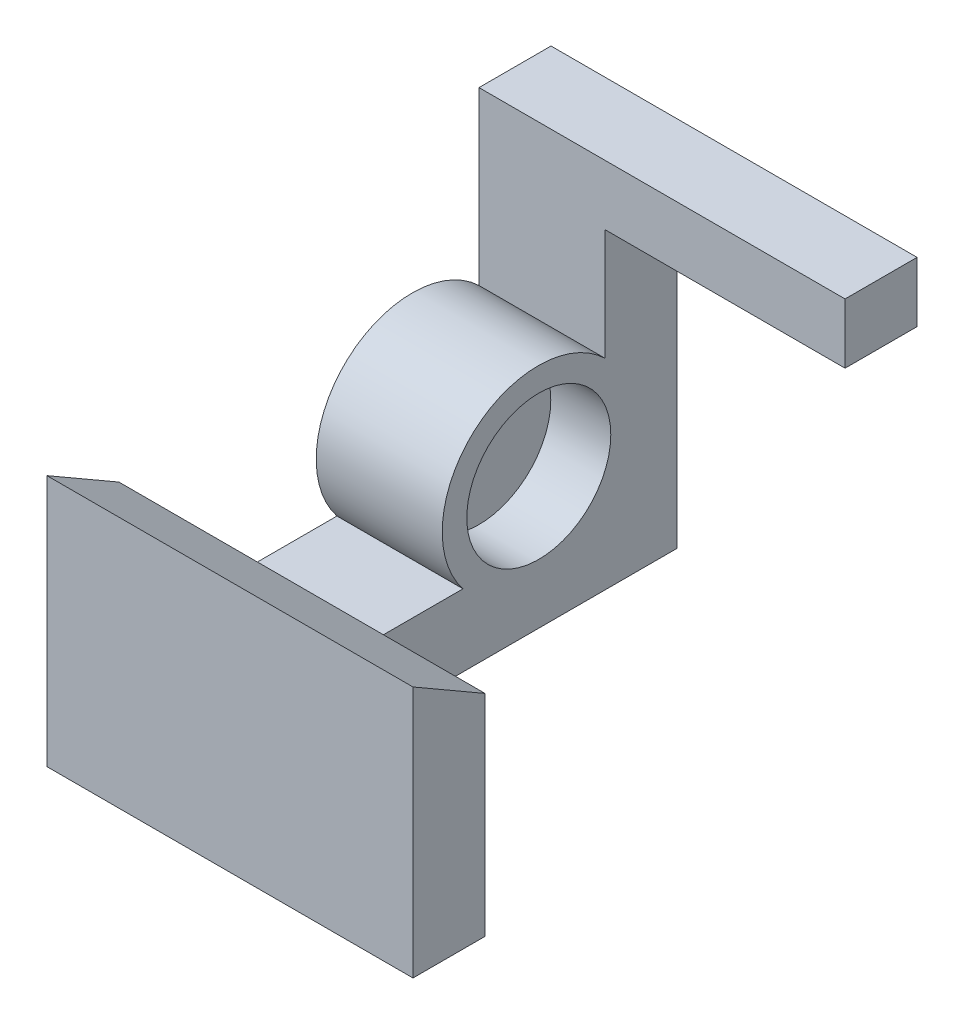
ISO-10303-21;
HEADER;
FILE_DESCRIPTION(('STEP AP214'),'2;1');
FILE_NAME('part.step','',(''),(''),'','','');
FILE_SCHEMA(('AUTOMOTIVE_DESIGN { 1 0 10303 214 1 1 1 1 }'));
ENDSEC;
DATA;
#1=APPLICATION_CONTEXT('core data for automotive mechanical design processes');
#2=APPLICATION_PROTOCOL_DEFINITION('international standard','automotive_design',2000,#1);
#3=PRODUCT_CONTEXT('',#1,'mechanical');
#4=PRODUCT('Part','Part','',(#3));
#5=PRODUCT_RELATED_PRODUCT_CATEGORY('part','',(#4));
#6=PRODUCT_DEFINITION_FORMATION('','',#4);
#7=PRODUCT_DEFINITION_CONTEXT('part definition',#1,'design');
#8=PRODUCT_DEFINITION('design','',#6,#7);
#9=PRODUCT_DEFINITION_SHAPE('','',#8);
#10=(LENGTH_UNIT() NAMED_UNIT(*) SI_UNIT(.MILLI.,.METRE.));
#11=(NAMED_UNIT(*) PLANE_ANGLE_UNIT() SI_UNIT($,.RADIAN.));
#12=(NAMED_UNIT(*) SI_UNIT($,.STERADIAN.) SOLID_ANGLE_UNIT());
#13=UNCERTAINTY_MEASURE_WITH_UNIT(LENGTH_MEASURE(1.E-05),#10,'distance_accuracy_value','');
#14=(GEOMETRIC_REPRESENTATION_CONTEXT(3) GLOBAL_UNCERTAINTY_ASSIGNED_CONTEXT((#13)) GLOBAL_UNIT_ASSIGNED_CONTEXT((#10,
#11,#12)) REPRESENTATION_CONTEXT('',''));
#15=CARTESIAN_POINT('',(0.,0.,0.));
#16=DIRECTION('',(0.,0.,1.));
#17=DIRECTION('',(1.,0.,0.));
#18=AXIS2_PLACEMENT_3D('',#15,#16,#17);
#19=CARTESIAN_POINT('',(-10.5,5.92715231788079,8.85107205144952));
#20=DIRECTION('',(1.,0.,0.));
#21=DIRECTION('',(0.,0.,-1.));
#22=AXIS2_PLACEMENT_3D('',#19,#20,#21);
#23=PLANE('',#22);
#24=DIRECTION('',(0.,-0.500000000000004,-0.866025403784436));
#25=VECTOR('',#24,1.);
#26=CARTESIAN_POINT('',(-10.5,15.9602649006623,39.2881581441647));
#27=LINE('',#26,#25);
#28=CARTESIAN_POINT('',(-10.5,15.9602649006623,39.2881581441647));
#29=VERTEX_POINT('',#28);
#30=CARTESIAN_POINT('',(-10.5,12.4961632855245,33.2881581441647));
#31=VERTEX_POINT('',#30);
#32=EDGE_CURVE('E132',#29,#31,#27,.T.);
#33=ORIENTED_EDGE('',*,*,#32,.T.);
#34=DIRECTION('',(0.,-1.,0.));
#35=VECTOR('',#34,1.);
#36=CARTESIAN_POINT('',(-10.5,15.9602649006623,33.2881581441647));
#37=LINE('',#36,#35);
#38=CARTESIAN_POINT('',(-10.5,0.960264900662255,33.2881581441647));
#39=VERTEX_POINT('',#38);
#40=EDGE_CURVE('E141',#31,#39,#37,.T.);
#41=ORIENTED_EDGE('',*,*,#40,.T.);
#42=DIRECTION('',(0.,0.,1.));
#43=VECTOR('',#42,1.);
#44=CARTESIAN_POINT('',(-10.5,0.960264900662257,15.1224378823253));
#45=LINE('',#44,#43);
#46=CARTESIAN_POINT('',(-10.5,0.960264900662259,15.1224378823253));
#47=VERTEX_POINT('',#46);
#48=EDGE_CURVE('E205',#47,#39,#45,.T.);
#49=ORIENTED_EDGE('',*,*,#48,.F.);
#50=CARTESIAN_POINT('',(-10.5,5.92715231788079,8.85107205144952));
#51=DIRECTION('',(1.,0.,0.));
#52=DIRECTION('',(0.,0.,-1.));
#53=AXIS2_PLACEMENT_3D('',#50,#51,#52);
#54=CIRCLE('',#53,8.);
#55=CARTESIAN_POINT('',(-10.5,11.676412171126,3.28815814416473));
#56=VERTEX_POINT('',#55);
#57=EDGE_CURVE('E203',#56,#47,#54,.T.);
#58=ORIENTED_EDGE('',*,*,#57,.F.);
#59=DIRECTION('',(0.,-1.,0.));
#60=VECTOR('',#59,1.);
#61=CARTESIAN_POINT('',(-10.5,20.9602649006623,3.28815814416473));
#62=LINE('',#61,#60);
#63=CARTESIAN_POINT('',(-10.5,25.9602649006623,3.28815814416473));
#64=VERTEX_POINT('',#63);
#65=EDGE_CURVE('E199',#64,#56,#62,.T.);
#66=ORIENTED_EDGE('',*,*,#65,.F.);
#67=DIRECTION('',(0.,0.,1.));
#68=VECTOR('',#67,1.);
#69=CARTESIAN_POINT('',(-10.5,25.9602649006623,-2.71184185583527));
#70=LINE('',#69,#68);
#71=CARTESIAN_POINT('',(-10.5,25.9602649006623,-2.71184185583527));
#72=VERTEX_POINT('',#71);
#73=EDGE_CURVE('E176',#72,#64,#70,.T.);
#74=ORIENTED_EDGE('',*,*,#73,.F.);
#75=DIRECTION('',(0.,1.,0.));
#76=VECTOR('',#75,1.);
#77=CARTESIAN_POINT('',(-10.5,20.9602649006623,-2.71184185583527));
#78=LINE('',#77,#76);
#79=CARTESIAN_POINT('',(-10.5,-5.03973509933774,-2.71184185583527));
#80=VERTEX_POINT('',#79);
#81=EDGE_CURVE('E197',#80,#72,#78,.T.);
#82=ORIENTED_EDGE('',*,*,#81,.F.);
#83=DIRECTION('',(0.,0.,-1.));
#84=VECTOR('',#83,1.);
#85=CARTESIAN_POINT('',(-10.5,-5.03973509933774,-2.71184185583527));
#86=LINE('',#85,#84);
#87=CARTESIAN_POINT('',(-10.5,-5.03973509933774,39.2881581441647));
#88=VERTEX_POINT('',#87);
#89=EDGE_CURVE('E207',#88,#80,#86,.T.);
#90=ORIENTED_EDGE('',*,*,#89,.F.);
#91=DIRECTION('',(0.,-1.,0.));
#92=VECTOR('',#91,1.);
#93=CARTESIAN_POINT('',(-10.5,-5.03973509933774,39.2881581441647));
#94=LINE('',#93,#92);
#95=EDGE_CURVE('E144',#29,#88,#94,.T.);
#96=ORIENTED_EDGE('',*,*,#95,.F.);
#97=EDGE_LOOP('',(#33,#41,#49,#58,#66,#74,#82,#90,#96));
#98=FACE_BOUND('',#97,.T.);
#99=ADVANCED_FACE('F32',(#98),#23,.F.);
#100=CARTESIAN_POINT('',(0.,0.,33.2881581441647));
#101=DIRECTION('',(0.,0.,-1.));
#102=DIRECTION('',(-1.,0.,0.));
#103=AXIS2_PLACEMENT_3D('',#100,#101,#102);
#104=PLANE('',#103);
#105=ORIENTED_EDGE('',*,*,#40,.F.);
#106=DIRECTION('',(-1.,0.,0.));
#107=VECTOR('',#106,1.);
#108=CARTESIAN_POINT('',(20.000025,12.4961632855245,33.2881581441647));
#109=LINE('',#108,#107);
#110=CARTESIAN_POINT('',(20.,12.4961632855245,33.2881581441647));
#111=VERTEX_POINT('',#110);
#112=EDGE_CURVE('E129',#111,#31,#109,.T.);
#113=ORIENTED_EDGE('',*,*,#112,.F.);
#114=DIRECTION('',(0.,1.,0.));
#115=VECTOR('',#114,1.);
#116=CARTESIAN_POINT('',(20.,-5.03973509933774,33.2881581441647));
#117=LINE('',#116,#115);
#118=CARTESIAN_POINT('',(20.,-5.03973509933774,33.2881581441647));
#119=VERTEX_POINT('',#118);
#120=EDGE_CURVE('E165',#119,#111,#117,.T.);
#121=ORIENTED_EDGE('',*,*,#120,.F.);
#122=DIRECTION('',(1.,0.,0.));
#123=VECTOR('',#122,1.);
#124=CARTESIAN_POINT('',(-10.5,-5.03973509933774,33.2881581441647));
#125=LINE('',#124,#123);
#126=CARTESIAN_POINT('',(0.,-5.03973509933774,33.2881581441647));
#127=VERTEX_POINT('',#126);
#128=EDGE_CURVE('E71',#127,#119,#125,.T.);
#129=ORIENTED_EDGE('',*,*,#128,.F.);
#130=DIRECTION('',(0.,-1.,0.));
#131=VECTOR('',#130,1.);
#132=CARTESIAN_POINT('',(0.,0.960264900662255,33.2881581441647));
#133=LINE('',#132,#131);
#134=CARTESIAN_POINT('',(0.,0.960264900662255,33.2881581441647));
#135=VERTEX_POINT('',#134);
#136=EDGE_CURVE('E227',#135,#127,#133,.T.);
#137=ORIENTED_EDGE('',*,*,#136,.F.);
#138=DIRECTION('',(-1.,0.,0.));
#139=VECTOR('',#138,1.);
#140=CARTESIAN_POINT('',(20.,0.960264900662255,33.2881581441647));
#141=LINE('',#140,#139);
#142=EDGE_CURVE('E148',#135,#39,#141,.T.);
#143=ORIENTED_EDGE('',*,*,#142,.T.);
#144=EDGE_LOOP('',(#105,#113,#121,#129,#137,#143));
#145=FACE_BOUND('',#144,.T.);
#146=ADVANCED_FACE('F147',(#145),#104,.T.);
#147=CARTESIAN_POINT('',(20.,-5.03973509933774,39.2881581441647));
#148=DIRECTION('',(-1.,0.,0.));
#149=DIRECTION('',(0.,-1.,0.));
#150=AXIS2_PLACEMENT_3D('',#147,#148,#149);
#151=PLANE('',#150);
#152=DIRECTION('',(0.,-0.500000000000005,-0.866025403784436));
#153=VECTOR('',#152,1.);
#154=CARTESIAN_POINT('',(20.,10.7102649006622,30.1948914044281));
#155=LINE('',#154,#153);
#156=CARTESIAN_POINT('',(20.,15.9602649006623,39.2881581441647));
#157=VERTEX_POINT('',#156);
#158=EDGE_CURVE('E135',#157,#111,#155,.T.);
#159=ORIENTED_EDGE('',*,*,#158,.F.);
#160=DIRECTION('',(0.,1.,0.));
#161=VECTOR('',#160,1.);
#162=CARTESIAN_POINT('',(20.,-5.03973509933774,39.2881581441647));
#163=LINE('',#162,#161);
#164=CARTESIAN_POINT('',(20.,-5.03973509933774,39.2881581441647));
#165=VERTEX_POINT('',#164);
#166=EDGE_CURVE('E167',#165,#157,#163,.T.);
#167=ORIENTED_EDGE('',*,*,#166,.F.);
#168=DIRECTION('',(0.,0.,-1.));
#169=VECTOR('',#168,1.);
#170=CARTESIAN_POINT('',(20.,-5.03973509933774,39.2881581441647));
#171=LINE('',#170,#169);
#172=EDGE_CURVE('E170',#165,#119,#171,.T.);
#173=ORIENTED_EDGE('',*,*,#172,.T.);
#174=ORIENTED_EDGE('',*,*,#120,.T.);
#175=EDGE_LOOP('',(#159,#167,#173,#174));
#176=FACE_BOUND('',#175,.T.);
#177=ADVANCED_FACE('F262',(#176),#151,.F.);
#178=CARTESIAN_POINT('',(-10.5,0.960264900662257,15.1224378823253));
#179=DIRECTION('',(0.,1.,0.));
#180=DIRECTION('',(0.,0.,1.));
#181=AXIS2_PLACEMENT_3D('',#178,#179,#180);
#182=PLANE('',#181);
#183=ORIENTED_EDGE('',*,*,#48,.T.);
#184=ORIENTED_EDGE('',*,*,#142,.F.);
#185=DIRECTION('',(0.,0.,1.));
#186=VECTOR('',#185,1.);
#187=CARTESIAN_POINT('',(0.,0.960264900662257,15.1224378823253));
#188=LINE('',#187,#186);
#189=CARTESIAN_POINT('',(0.,0.960264900662259,15.1224378823253));
#190=VERTEX_POINT('',#189);
#191=EDGE_CURVE('E229',#190,#135,#188,.T.);
#192=ORIENTED_EDGE('',*,*,#191,.F.);
#193=DIRECTION('',(1.,0.,0.));
#194=VECTOR('',#193,1.);
#195=CARTESIAN_POINT('',(-10.5,0.960264900662259,15.1224378823253));
#196=LINE('',#195,#194);
#197=EDGE_CURVE('E42',#47,#190,#196,.T.);
#198=ORIENTED_EDGE('',*,*,#197,.F.);
#199=EDGE_LOOP('',(#183,#184,#192,#198));
#200=FACE_BOUND('',#199,.T.);
#201=ADVANCED_FACE('F244',(#200),#182,.T.);
#202=CARTESIAN_POINT('',(-10.5,20.9602649006623,-2.71184185583527));
#203=DIRECTION('',(0.,0.,-1.));
#204=DIRECTION('',(0.,1.,0.));
#205=AXIS2_PLACEMENT_3D('',#202,#203,#204);
#206=PLANE('',#205);
#207=DIRECTION('',(0.,1.,0.));
#208=VECTOR('',#207,1.);
#209=CARTESIAN_POINT('',(0.,20.9602649006623,-2.71184185583527));
#210=LINE('',#209,#208);
#211=CARTESIAN_POINT('',(0.,-5.03973509933774,-2.71184185583527));
#212=VERTEX_POINT('',#211);
#213=CARTESIAN_POINT('',(0.,20.9602649006623,-2.71184185583527));
#214=VERTEX_POINT('',#213);
#215=EDGE_CURVE('E219',#212,#214,#210,.T.);
#216=ORIENTED_EDGE('',*,*,#215,.F.);
#217=DIRECTION('',(1.,0.,0.));
#218=VECTOR('',#217,1.);
#219=CARTESIAN_POINT('',(-10.5,-5.03973509933774,-2.71184185583527));
#220=LINE('',#219,#218);
#221=EDGE_CURVE('E11',#80,#212,#220,.T.);
#222=ORIENTED_EDGE('',*,*,#221,.F.);
#223=ORIENTED_EDGE('',*,*,#81,.T.);
#224=DIRECTION('',(-1.,0.,0.));
#225=VECTOR('',#224,1.);
#226=CARTESIAN_POINT('',(-10.5,25.9602649006623,-2.71184185583527));
#227=LINE('',#226,#225);
#228=CARTESIAN_POINT('',(20.,25.9602649006623,-2.71184185583527));
#229=VERTEX_POINT('',#228);
#230=EDGE_CURVE('E184',#229,#72,#227,.T.);
#231=ORIENTED_EDGE('',*,*,#230,.F.);
#232=DIRECTION('',(0.,-1.,0.));
#233=VECTOR('',#232,1.);
#234=CARTESIAN_POINT('',(20.,25.9602649006623,-2.71184185583527));
#235=LINE('',#234,#233);
#236=CARTESIAN_POINT('',(20.,20.9602649006623,-2.71184185583527));
#237=VERTEX_POINT('',#236);
#238=EDGE_CURVE('E187',#229,#237,#235,.T.);
#239=ORIENTED_EDGE('',*,*,#238,.T.);
#240=DIRECTION('',(-1.,0.,0.));
#241=VECTOR('',#240,1.);
#242=CARTESIAN_POINT('',(-10.5,20.9602649006623,-2.71184185583527));
#243=LINE('',#242,#241);
#244=EDGE_CURVE('E180',#237,#214,#243,.T.);
#245=ORIENTED_EDGE('',*,*,#244,.T.);
#246=EDGE_LOOP('',(#216,#222,#223,#231,#239,#245));
#247=FACE_BOUND('',#246,.T.);
#248=ADVANCED_FACE('F34',(#247),#206,.T.);
#249=CARTESIAN_POINT('',(-10.5,-5.03973509933774,-2.71184185583527));
#250=DIRECTION('',(0.,-1.,0.));
#251=DIRECTION('',(0.,0.,-1.));
#252=AXIS2_PLACEMENT_3D('',#249,#250,#251);
#253=PLANE('',#252);
#254=DIRECTION('',(0.,0.,-1.));
#255=VECTOR('',#254,1.);
#256=CARTESIAN_POINT('',(0.,-5.03973509933774,-2.71184185583527));
#257=LINE('',#256,#255);
#258=EDGE_CURVE('E200',#127,#212,#257,.T.);
#259=ORIENTED_EDGE('',*,*,#258,.F.);
#260=ORIENTED_EDGE('',*,*,#128,.T.);
#261=ORIENTED_EDGE('',*,*,#172,.F.);
#262=DIRECTION('',(1.,0.,0.));
#263=VECTOR('',#262,1.);
#264=CARTESIAN_POINT('',(-10.5,-5.03973509933774,39.2881581441647));
#265=LINE('',#264,#263);
#266=EDGE_CURVE('E164',#88,#165,#265,.T.);
#267=ORIENTED_EDGE('',*,*,#266,.F.);
#268=ORIENTED_EDGE('',*,*,#89,.T.);
#269=ORIENTED_EDGE('',*,*,#221,.T.);
#270=EDGE_LOOP('',(#259,#260,#261,#267,#268,#269));
#271=FACE_BOUND('',#270,.T.);
#272=ADVANCED_FACE('F248',(#271),#253,.T.);
#273=CARTESIAN_POINT('',(-10.5,5.92715231788079,8.85107205144952));
#274=DIRECTION('',(1.,0.,0.));
#275=DIRECTION('',(0.,0.,-1.));
#276=AXIS2_PLACEMENT_3D('',#273,#274,#275);
#277=CYLINDRICAL_SURFACE('',#276,8.);
#278=CARTESIAN_POINT('',(0.,5.92715231788079,8.85107205144952));
#279=DIRECTION('',(1.,0.,0.));
#280=DIRECTION('',(0.,0.,-1.));
#281=AXIS2_PLACEMENT_3D('',#278,#279,#280);
#282=CIRCLE('',#281,8.);
#283=CARTESIAN_POINT('',(0.,11.676412171126,3.28815814416473));
#284=VERTEX_POINT('',#283);
#285=EDGE_CURVE('E211',#284,#190,#282,.T.);
#286=ORIENTED_EDGE('',*,*,#285,.F.);
#287=DIRECTION('',(1.,0.,0.));
#288=VECTOR('',#287,1.);
#289=CARTESIAN_POINT('',(-10.5,11.676412171126,3.28815814416473));
#290=LINE('',#289,#288);
#291=EDGE_CURVE('E80',#56,#284,#290,.T.);
#292=ORIENTED_EDGE('',*,*,#291,.F.);
#293=ORIENTED_EDGE('',*,*,#57,.T.);
#294=ORIENTED_EDGE('',*,*,#197,.T.);
#295=EDGE_LOOP('',(#286,#292,#293,#294));
#296=FACE_BOUND('',#295,.T.);
#297=ADVANCED_FACE('F245',(#296),#277,.T.);
#298=CARTESIAN_POINT('',(-10.5,20.9602649006623,3.28815814416473));
#299=DIRECTION('',(0.,0.,1.));
#300=DIRECTION('',(1.,0.,0.));
#301=AXIS2_PLACEMENT_3D('',#298,#299,#300);
#302=PLANE('',#301);
#303=DIRECTION('',(0.,-1.,0.));
#304=VECTOR('',#303,1.);
#305=CARTESIAN_POINT('',(0.,20.9602649006623,3.28815814416473));
#306=LINE('',#305,#304);
#307=CARTESIAN_POINT('',(0.,20.9602649006623,3.28815814416473));
#308=VERTEX_POINT('',#307);
#309=EDGE_CURVE('E218',#308,#284,#306,.T.);
#310=ORIENTED_EDGE('',*,*,#309,.F.);
#311=DIRECTION('',(1.,0.,0.));
#312=VECTOR('',#311,1.);
#313=CARTESIAN_POINT('',(-10.5,20.9602649006623,3.28815814416473));
#314=LINE('',#313,#312);
#315=CARTESIAN_POINT('',(20.,20.9602649006623,3.28815814416473));
#316=VERTEX_POINT('',#315);
#317=EDGE_CURVE('E193',#308,#316,#314,.T.);
#318=ORIENTED_EDGE('',*,*,#317,.T.);
#319=DIRECTION('',(0.,-1.,0.));
#320=VECTOR('',#319,1.);
#321=CARTESIAN_POINT('',(20.,25.9602649006623,3.28815814416473));
#322=LINE('',#321,#320);
#323=CARTESIAN_POINT('',(20.,25.9602649006623,3.28815814416473));
#324=VERTEX_POINT('',#323);
#325=EDGE_CURVE('E224',#324,#316,#322,.T.);
#326=ORIENTED_EDGE('',*,*,#325,.F.);
#327=DIRECTION('',(1.,0.,0.));
#328=VECTOR('',#327,1.);
#329=CARTESIAN_POINT('',(-10.5,25.9602649006623,3.28815814416473));
#330=LINE('',#329,#328);
#331=EDGE_CURVE('E179',#64,#324,#330,.T.);
#332=ORIENTED_EDGE('',*,*,#331,.F.);
#333=ORIENTED_EDGE('',*,*,#65,.T.);
#334=ORIENTED_EDGE('',*,*,#291,.T.);
#335=EDGE_LOOP('',(#310,#318,#326,#332,#333,#334));
#336=FACE_BOUND('',#335,.T.);
#337=ADVANCED_FACE('F247',(#336),#302,.T.);
#338=CARTESIAN_POINT('',(0.,5.92715231788079,8.85107205144952));
#339=DIRECTION('',(1.,0.,0.));
#340=DIRECTION('',(0.,0.,-1.));
#341=AXIS2_PLACEMENT_3D('',#338,#339,#340);
#342=PLANE('',#341);
#343=CARTESIAN_POINT('',(0.,5.92386765901937,8.80693946290523));
#344=DIRECTION('',(1.,0.,0.));
#345=DIRECTION('',(0.,0.,-1.));
#346=AXIS2_PLACEMENT_3D('',#343,#344,#345);
#347=CIRCLE('',#346,6.);
#348=CARTESIAN_POINT('',(0.,5.92386765901937,2.80693946290523));
#349=VERTEX_POINT('',#348);
#350=EDGE_CURVE('E150',#349,#349,#347,.T.);
#351=ORIENTED_EDGE('',*,*,#350,.F.);
#352=EDGE_LOOP('',(#351));
#353=FACE_BOUND('',#352,.T.);
#354=ORIENTED_EDGE('',*,*,#215,.T.);
#355=DIRECTION('',(0.,0.,1.));
#356=VECTOR('',#355,1.);
#357=CARTESIAN_POINT('',(0.,20.9602649006623,-2.71184185583527));
#358=LINE('',#357,#356);
#359=EDGE_CURVE('E214',#214,#308,#358,.T.);
#360=ORIENTED_EDGE('',*,*,#359,.T.);
#361=ORIENTED_EDGE('',*,*,#309,.T.);
#362=ORIENTED_EDGE('',*,*,#285,.T.);
#363=ORIENTED_EDGE('',*,*,#191,.T.);
#364=ORIENTED_EDGE('',*,*,#136,.T.);
#365=ORIENTED_EDGE('',*,*,#258,.T.);
#366=EDGE_LOOP('',(#354,#360,#361,#362,#363,#364,#365));
#367=FACE_BOUND('',#366,.T.);
#368=ADVANCED_FACE('F241',(#353,#367),#342,.T.);
#369=CARTESIAN_POINT('',(20.,25.9602649006623,-2.71184185583527));
#370=DIRECTION('',(-1.,0.,0.));
#371=DIRECTION('',(0.,0.,1.));
#372=AXIS2_PLACEMENT_3D('',#369,#370,#371);
#373=PLANE('',#372);
#374=DIRECTION('',(0.,0.,-1.));
#375=VECTOR('',#374,1.);
#376=CARTESIAN_POINT('',(20.,20.9602649006623,-2.71184185583527));
#377=LINE('',#376,#375);
#378=EDGE_CURVE('E190',#316,#237,#377,.T.);
#379=ORIENTED_EDGE('',*,*,#378,.T.);
#380=ORIENTED_EDGE('',*,*,#238,.F.);
#381=DIRECTION('',(0.,0.,-1.));
#382=VECTOR('',#381,1.);
#383=CARTESIAN_POINT('',(20.,25.9602649006623,-2.71184185583527));
#384=LINE('',#383,#382);
#385=EDGE_CURVE('E182',#324,#229,#384,.T.);
#386=ORIENTED_EDGE('',*,*,#385,.F.);
#387=ORIENTED_EDGE('',*,*,#325,.T.);
#388=EDGE_LOOP('',(#379,#380,#386,#387));
#389=FACE_BOUND('',#388,.T.);
#390=ADVANCED_FACE('F266',(#389),#373,.F.);
#391=CARTESIAN_POINT('',(0.,25.9602649006623,0.));
#392=DIRECTION('',(0.,1.,0.));
#393=DIRECTION('',(0.,0.,1.));
#394=AXIS2_PLACEMENT_3D('',#391,#392,#393);
#395=PLANE('',#394);
#396=ORIENTED_EDGE('',*,*,#73,.T.);
#397=ORIENTED_EDGE('',*,*,#331,.T.);
#398=ORIENTED_EDGE('',*,*,#385,.T.);
#399=ORIENTED_EDGE('',*,*,#230,.T.);
#400=EDGE_LOOP('',(#396,#397,#398,#399));
#401=FACE_BOUND('',#400,.T.);
#402=ADVANCED_FACE('F281',(#401),#395,.T.);
#403=CARTESIAN_POINT('',(0.,20.9602649006623,0.));
#404=DIRECTION('',(0.,1.,0.));
#405=DIRECTION('',(0.,0.,1.));
#406=AXIS2_PLACEMENT_3D('',#403,#404,#405);
#407=PLANE('',#406);
#408=ORIENTED_EDGE('',*,*,#359,.F.);
#409=ORIENTED_EDGE('',*,*,#244,.F.);
#410=ORIENTED_EDGE('',*,*,#378,.F.);
#411=ORIENTED_EDGE('',*,*,#317,.F.);
#412=EDGE_LOOP('',(#408,#409,#410,#411));
#413=FACE_BOUND('',#412,.T.);
#414=ADVANCED_FACE('F283',(#413),#407,.F.);
#415=CARTESIAN_POINT('',(0.,0.,39.2881581441647));
#416=DIRECTION('',(0.,0.,-1.));
#417=DIRECTION('',(-1.,0.,0.));
#418=AXIS2_PLACEMENT_3D('',#415,#416,#417);
#419=PLANE('',#418);
#420=ORIENTED_EDGE('',*,*,#95,.T.);
#421=ORIENTED_EDGE('',*,*,#266,.T.);
#422=ORIENTED_EDGE('',*,*,#166,.T.);
#423=DIRECTION('',(1.,0.,0.));
#424=VECTOR('',#423,1.);
#425=CARTESIAN_POINT('',(20.,15.9602649006623,39.2881581441647));
#426=LINE('',#425,#424);
#427=EDGE_CURVE('E151',#29,#157,#426,.T.);
#428=ORIENTED_EDGE('',*,*,#427,.F.);
#429=EDGE_LOOP('',(#420,#421,#422,#428));
#430=FACE_BOUND('',#429,.T.);
#431=ADVANCED_FACE('F286',(#430),#419,.F.);
#432=CARTESIAN_POINT('',(-5.,5.92386765901937,8.80693946290523));
#433=DIRECTION('',(1.,0.,0.));
#434=DIRECTION('',(0.,0.,-1.));
#435=AXIS2_PLACEMENT_3D('',#432,#433,#434);
#436=CYLINDRICAL_SURFACE('',#435,6.);
#437=CARTESIAN_POINT('',(-5.,5.92386765901937,8.80693946290523));
#438=DIRECTION('',(1.,0.,0.));
#439=DIRECTION('',(0.,0.,-1.));
#440=AXIS2_PLACEMENT_3D('',#437,#438,#439);
#441=CIRCLE('',#440,6.);
#442=CARTESIAN_POINT('',(-5.,5.92386765901937,2.80693946290523));
#443=VERTEX_POINT('',#442);
#444=EDGE_CURVE('E154',#443,#443,#441,.T.);
#445=ORIENTED_EDGE('',*,*,#444,.F.);
#446=EDGE_LOOP('',(#445));
#447=FACE_BOUND('',#446,.T.);
#448=ORIENTED_EDGE('',*,*,#350,.T.);
#449=EDGE_LOOP('',(#448));
#450=FACE_BOUND('',#449,.T.);
#451=ADVANCED_FACE('F291',(#447,#450),#436,.F.);
#452=CARTESIAN_POINT('',(-5.,5.92386765901937,8.80693946290523));
#453=DIRECTION('',(1.,0.,0.));
#454=DIRECTION('',(0.,0.,-1.));
#455=AXIS2_PLACEMENT_3D('',#452,#453,#454);
#456=PLANE('',#455);
#457=ORIENTED_EDGE('',*,*,#444,.T.);
#458=EDGE_LOOP('',(#457));
#459=FACE_BOUND('',#458,.T.);
#460=ADVANCED_FACE('F342',(#459),#456,.T.);
#461=CARTESIAN_POINT('',(20.000025,15.9602649006623,39.2881581441647));
#462=DIRECTION('',(0.,0.866025403784436,-0.500000000000005));
#463=DIRECTION('',(0.,0.500000000000005,0.866025403784436));
#464=AXIS2_PLACEMENT_3D('',#461,#462,#463);
#465=PLANE('',#464);
#466=ORIENTED_EDGE('',*,*,#158,.T.);
#467=ORIENTED_EDGE('',*,*,#112,.T.);
#468=ORIENTED_EDGE('',*,*,#32,.F.);
#469=ORIENTED_EDGE('',*,*,#427,.T.);
#470=EDGE_LOOP('',(#466,#467,#468,#469));
#471=FACE_BOUND('',#470,.T.);
#472=ADVANCED_FACE('F131',(#471),#465,.T.);
#473=CLOSED_SHELL('',(#99,#146,#177,#201,#248,#272,#297,#337,#368,#390,#402,#414,#431,#451,#460,#472));
#474=MANIFOLD_SOLID_BREP('B2',#473);
#475=ADVANCED_BREP_SHAPE_REPRESENTATION('',(#18,#474),#14);
#476=SHAPE_DEFINITION_REPRESENTATION(#9,#475);
ENDSEC;
END-ISO-10303-21;
